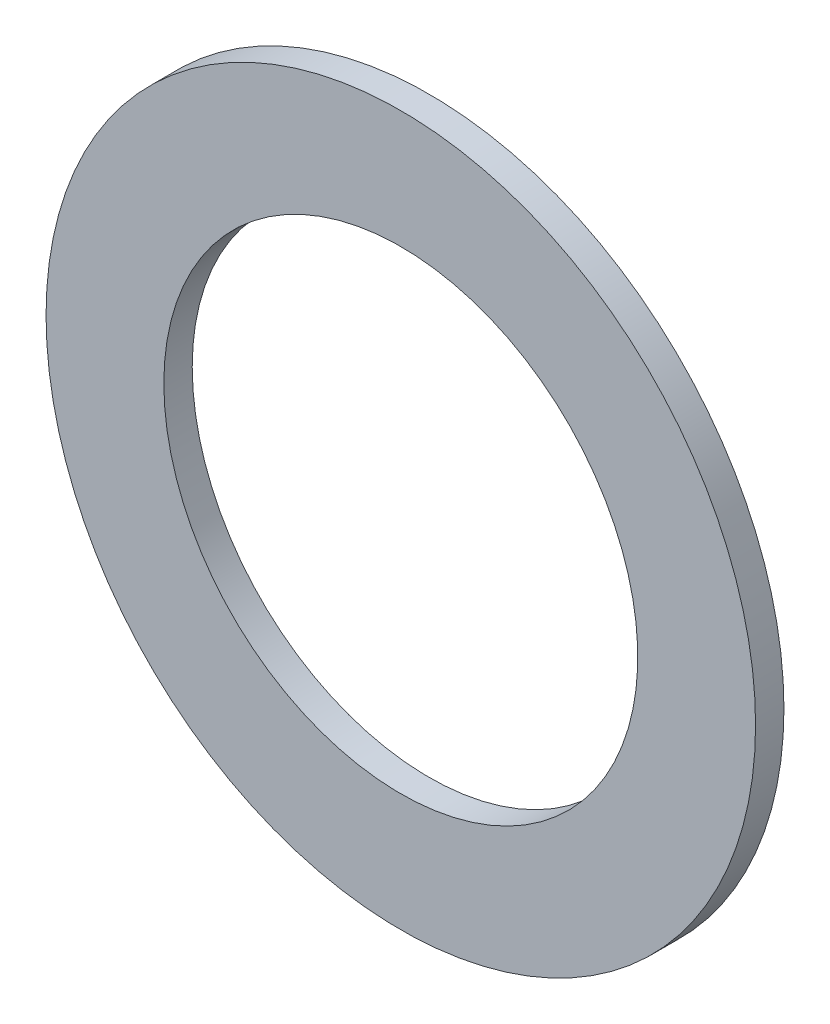
ISO-10303-21;
HEADER;
FILE_DESCRIPTION(('STEP AP214'),'2;1');
FILE_NAME('part.step','',(''),(''),'','','');
FILE_SCHEMA(('AUTOMOTIVE_DESIGN { 1 0 10303 214 1 1 1 1 }'));
ENDSEC;
DATA;
#1=APPLICATION_CONTEXT('core data for automotive mechanical design processes');
#2=APPLICATION_PROTOCOL_DEFINITION('international standard','automotive_design',2000,#1);
#3=PRODUCT_CONTEXT('',#1,'mechanical');
#4=PRODUCT('Part','Part','',(#3));
#5=PRODUCT_RELATED_PRODUCT_CATEGORY('part','',(#4));
#6=PRODUCT_DEFINITION_FORMATION('','',#4);
#7=PRODUCT_DEFINITION_CONTEXT('part definition',#1,'design');
#8=PRODUCT_DEFINITION('design','',#6,#7);
#9=PRODUCT_DEFINITION_SHAPE('','',#8);
#10=(LENGTH_UNIT() NAMED_UNIT(*) SI_UNIT(.MILLI.,.METRE.));
#11=(NAMED_UNIT(*) PLANE_ANGLE_UNIT() SI_UNIT($,.RADIAN.));
#12=(NAMED_UNIT(*) SI_UNIT($,.STERADIAN.) SOLID_ANGLE_UNIT());
#13=UNCERTAINTY_MEASURE_WITH_UNIT(LENGTH_MEASURE(1.E-05),#10,'distance_accuracy_value','');
#14=(GEOMETRIC_REPRESENTATION_CONTEXT(3) GLOBAL_UNCERTAINTY_ASSIGNED_CONTEXT((#13)) GLOBAL_UNIT_ASSIGNED_CONTEXT((#10,
#11,#12)) REPRESENTATION_CONTEXT('',''));
#15=CARTESIAN_POINT('',(0.,0.,0.));
#16=DIRECTION('',(0.,0.,1.));
#17=DIRECTION('',(1.,0.,0.));
#18=AXIS2_PLACEMENT_3D('',#15,#16,#17);
#19=CARTESIAN_POINT('',(0.,0.,-0.381));
#20=DIRECTION('',(0.,0.,1.));
#21=DIRECTION('',(1.,0.,0.));
#22=AXIS2_PLACEMENT_3D('',#19,#20,#21);
#23=PLANE('',#22);
#24=CARTESIAN_POINT('',(0.,0.,-0.381));
#25=DIRECTION('',(0.,0.,-1.));
#26=DIRECTION('',(-1.,0.,0.));
#27=AXIS2_PLACEMENT_3D('',#24,#25,#26);
#28=CIRCLE('',#27,6.3627);
#29=CARTESIAN_POINT('',(-6.3627,0.,-0.381));
#30=VERTEX_POINT('',#29);
#31=EDGE_CURVE('E27',#30,#30,#28,.F.);
#32=ORIENTED_EDGE('',*,*,#31,.T.);
#33=EDGE_LOOP('',(#32));
#34=FACE_BOUND('',#33,.T.);
#35=CARTESIAN_POINT('',(0.,0.,-0.381));
#36=DIRECTION('',(0.,0.,-1.));
#37=DIRECTION('',(-1.,0.,0.));
#38=AXIS2_PLACEMENT_3D('',#35,#36,#37);
#39=CIRCLE('',#38,9.525);
#40=CARTESIAN_POINT('',(-9.525,0.,-0.381));
#41=VERTEX_POINT('',#40);
#42=EDGE_CURVE('E18',#41,#41,#39,.F.);
#43=ORIENTED_EDGE('',*,*,#42,.F.);
#44=EDGE_LOOP('',(#43));
#45=FACE_BOUND('',#44,.T.);
#46=ADVANCED_FACE('F15',(#34,#45),#23,.F.);
#47=CARTESIAN_POINT('',(0.,0.,0.381));
#48=DIRECTION('',(0.,0.,-1.));
#49=DIRECTION('',(-1.,0.,0.));
#50=AXIS2_PLACEMENT_3D('',#47,#48,#49);
#51=CYLINDRICAL_SURFACE('',#50,9.525);
#52=ORIENTED_EDGE('',*,*,#42,.T.);
#53=EDGE_LOOP('',(#52));
#54=FACE_BOUND('',#53,.T.);
#55=CARTESIAN_POINT('',(0.,0.,0.381));
#56=DIRECTION('',(0.,0.,-1.));
#57=DIRECTION('',(-1.,0.,0.));
#58=AXIS2_PLACEMENT_3D('',#55,#56,#57);
#59=CIRCLE('',#58,9.525);
#60=CARTESIAN_POINT('',(-9.525,0.,0.381));
#61=VERTEX_POINT('',#60);
#62=EDGE_CURVE('E22',#61,#61,#59,.F.);
#63=ORIENTED_EDGE('',*,*,#62,.F.);
#64=EDGE_LOOP('',(#63));
#65=FACE_BOUND('',#64,.T.);
#66=ADVANCED_FACE('F35',(#54,#65),#51,.T.);
#67=CARTESIAN_POINT('',(0.,0.,0.381));
#68=DIRECTION('',(0.,0.,-1.));
#69=DIRECTION('',(-1.,0.,0.));
#70=AXIS2_PLACEMENT_3D('',#67,#68,#69);
#71=CYLINDRICAL_SURFACE('',#70,6.3627);
#72=CARTESIAN_POINT('',(0.,0.,0.381));
#73=DIRECTION('',(0.,0.,-1.));
#74=DIRECTION('',(-1.,0.,0.));
#75=AXIS2_PLACEMENT_3D('',#72,#73,#74);
#76=CIRCLE('',#75,6.3627);
#77=CARTESIAN_POINT('',(-6.3627,0.,0.381));
#78=VERTEX_POINT('',#77);
#79=EDGE_CURVE('E10',#78,#78,#76,.T.);
#80=ORIENTED_EDGE('',*,*,#79,.F.);
#81=EDGE_LOOP('',(#80));
#82=FACE_BOUND('',#81,.T.);
#83=ORIENTED_EDGE('',*,*,#31,.F.);
#84=EDGE_LOOP('',(#83));
#85=FACE_BOUND('',#84,.T.);
#86=ADVANCED_FACE('F43',(#82,#85),#71,.F.);
#87=CARTESIAN_POINT('',(0.,0.,0.381));
#88=DIRECTION('',(0.,0.,1.));
#89=DIRECTION('',(1.,0.,0.));
#90=AXIS2_PLACEMENT_3D('',#87,#88,#89);
#91=PLANE('',#90);
#92=ORIENTED_EDGE('',*,*,#79,.T.);
#93=EDGE_LOOP('',(#92));
#94=FACE_BOUND('',#93,.T.);
#95=ORIENTED_EDGE('',*,*,#62,.T.);
#96=EDGE_LOOP('',(#95));
#97=FACE_BOUND('',#96,.T.);
#98=ADVANCED_FACE('F44',(#94,#97),#91,.T.);
#99=CLOSED_SHELL('',(#46,#66,#86,#98));
#100=MANIFOLD_SOLID_BREP('B1',#99);
#101=ADVANCED_BREP_SHAPE_REPRESENTATION('',(#18,#100),#14);
#102=SHAPE_DEFINITION_REPRESENTATION(#9,#101);
ENDSEC;
END-ISO-10303-21;
